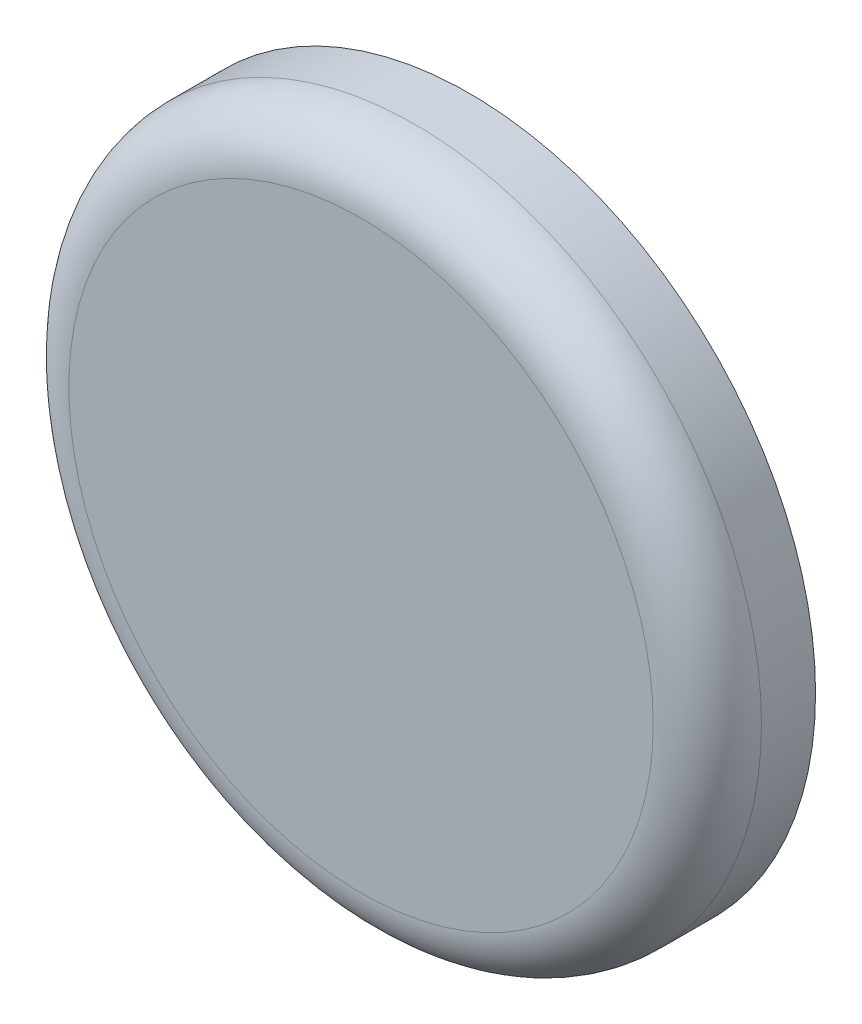
ISO-10303-21;
HEADER;
FILE_DESCRIPTION(('STEP AP214'),'2;1');
FILE_NAME('part.step','',(''),(''),'','','');
FILE_SCHEMA(('AUTOMOTIVE_DESIGN { 1 0 10303 214 1 1 1 1 }'));
ENDSEC;
DATA;
#1=APPLICATION_CONTEXT('core data for automotive mechanical design processes');
#2=APPLICATION_PROTOCOL_DEFINITION('international standard','automotive_design',2000,#1);
#3=PRODUCT_CONTEXT('',#1,'mechanical');
#4=PRODUCT('Part','Part','',(#3));
#5=PRODUCT_RELATED_PRODUCT_CATEGORY('part','',(#4));
#6=PRODUCT_DEFINITION_FORMATION('','',#4);
#7=PRODUCT_DEFINITION_CONTEXT('part definition',#1,'design');
#8=PRODUCT_DEFINITION('design','',#6,#7);
#9=PRODUCT_DEFINITION_SHAPE('','',#8);
#10=(LENGTH_UNIT() NAMED_UNIT(*) SI_UNIT(.MILLI.,.METRE.));
#11=(NAMED_UNIT(*) PLANE_ANGLE_UNIT() SI_UNIT($,.RADIAN.));
#12=(NAMED_UNIT(*) SI_UNIT($,.STERADIAN.) SOLID_ANGLE_UNIT());
#13=UNCERTAINTY_MEASURE_WITH_UNIT(LENGTH_MEASURE(1.E-05),#10,'distance_accuracy_value','');
#14=(GEOMETRIC_REPRESENTATION_CONTEXT(3) GLOBAL_UNCERTAINTY_ASSIGNED_CONTEXT((#13)) GLOBAL_UNIT_ASSIGNED_CONTEXT((#10,
#11,#12)) REPRESENTATION_CONTEXT('',''));
#15=CARTESIAN_POINT('',(0.,0.,0.));
#16=DIRECTION('',(0.,0.,1.));
#17=DIRECTION('',(1.,0.,0.));
#18=AXIS2_PLACEMENT_3D('',#15,#16,#17);
#19=CARTESIAN_POINT('',(0.,0.,10.));
#20=DIRECTION('',(0.,0.,-1.));
#21=DIRECTION('',(-1.,0.,0.));
#22=AXIS2_PLACEMENT_3D('',#19,#20,#21);
#23=CYLINDRICAL_SURFACE('',#22,32.);
#24=CARTESIAN_POINT('',(0.,0.,5.));
#25=DIRECTION('',(0.,0.,1.));
#26=DIRECTION('',(1.,0.,0.));
#27=AXIS2_PLACEMENT_3D('',#24,#25,#26);
#28=CIRCLE('',#27,32.);
#29=CARTESIAN_POINT('',(32.,0.,5.));
#30=VERTEX_POINT('',#29);
#31=EDGE_CURVE('E10',#30,#30,#28,.F.);
#32=ORIENTED_EDGE('',*,*,#31,.T.);
#33=EDGE_LOOP('',(#32));
#34=FACE_BOUND('',#33,.T.);
#35=CARTESIAN_POINT('',(0.,0.,0.));
#36=DIRECTION('',(0.,0.,1.));
#37=DIRECTION('',(1.,0.,0.));
#38=AXIS2_PLACEMENT_3D('',#35,#36,#37);
#39=CIRCLE('',#38,32.);
#40=CARTESIAN_POINT('',(32.,0.,0.));
#41=VERTEX_POINT('',#40);
#42=EDGE_CURVE('E48',#41,#41,#39,.T.);
#43=ORIENTED_EDGE('',*,*,#42,.T.);
#44=EDGE_LOOP('',(#43));
#45=FACE_BOUND('',#44,.T.);
#46=ADVANCED_FACE('F37',(#34,#45),#23,.T.);
#47=CARTESIAN_POINT('',(0.,0.,10.));
#48=DIRECTION('',(0.,0.,1.));
#49=DIRECTION('',(1.,0.,0.));
#50=AXIS2_PLACEMENT_3D('',#47,#48,#49);
#51=PLANE('',#50);
#52=CARTESIAN_POINT('',(0.,0.,10.));
#53=DIRECTION('',(0.,0.,1.));
#54=DIRECTION('',(1.,0.,0.));
#55=AXIS2_PLACEMENT_3D('',#52,#53,#54);
#56=CIRCLE('',#55,27.);
#57=CARTESIAN_POINT('',(27.,0.,10.));
#58=VERTEX_POINT('',#57);
#59=EDGE_CURVE('E44',#58,#58,#56,.T.);
#60=ORIENTED_EDGE('',*,*,#59,.T.);
#61=EDGE_LOOP('',(#60));
#62=FACE_BOUND('',#61,.T.);
#63=ADVANCED_FACE('F72',(#62),#51,.T.);
#64=CARTESIAN_POINT('',(0.,0.,0.));
#65=DIRECTION('',(0.,0.,1.));
#66=DIRECTION('',(1.,0.,0.));
#67=AXIS2_PLACEMENT_3D('',#64,#65,#66);
#68=PLANE('',#67);
#69=CARTESIAN_POINT('',(0.,0.,0.));
#70=DIRECTION('',(0.,0.,-1.));
#71=DIRECTION('',(-1.,0.,0.));
#72=AXIS2_PLACEMENT_3D('',#69,#70,#71);
#73=CIRCLE('',#72,27.);
#74=CARTESIAN_POINT('',(-27.,0.,0.));
#75=VERTEX_POINT('',#74);
#76=EDGE_CURVE('E55',#75,#75,#73,.T.);
#77=ORIENTED_EDGE('',*,*,#76,.F.);
#78=EDGE_LOOP('',(#77));
#79=FACE_BOUND('',#78,.T.);
#80=ORIENTED_EDGE('',*,*,#42,.F.);
#81=EDGE_LOOP('',(#80));
#82=FACE_BOUND('',#81,.T.);
#83=ADVANCED_FACE('F69',(#79,#82),#68,.F.);
#84=CARTESIAN_POINT('',(0.,0.,5.));
#85=DIRECTION('',(0.,0.,1.));
#86=DIRECTION('',(1.,0.,0.));
#87=AXIS2_PLACEMENT_3D('',#84,#85,#86);
#88=TOROIDAL_SURFACE('',#87,27.,5.);
#89=ORIENTED_EDGE('',*,*,#31,.F.);
#90=EDGE_LOOP('',(#89));
#91=FACE_BOUND('',#90,.T.);
#92=ORIENTED_EDGE('',*,*,#59,.F.);
#93=EDGE_LOOP('',(#92));
#94=FACE_BOUND('',#93,.T.);
#95=ADVANCED_FACE('F39',(#91,#94),#88,.T.);
#96=CARTESIAN_POINT('',(0.,0.,5.));
#97=DIRECTION('',(0.,0.,-1.));
#98=DIRECTION('',(-1.,0.,0.));
#99=AXIS2_PLACEMENT_3D('',#96,#97,#98);
#100=CYLINDRICAL_SURFACE('',#99,27.);
#101=CARTESIAN_POINT('',(0.,0.,5.));
#102=DIRECTION('',(0.,0.,-1.));
#103=DIRECTION('',(-1.,0.,0.));
#104=AXIS2_PLACEMENT_3D('',#101,#102,#103);
#105=CIRCLE('',#104,27.);
#106=CARTESIAN_POINT('',(-27.,0.,5.));
#107=VERTEX_POINT('',#106);
#108=EDGE_CURVE('E52',#107,#107,#105,.T.);
#109=ORIENTED_EDGE('',*,*,#108,.F.);
#110=EDGE_LOOP('',(#109));
#111=FACE_BOUND('',#110,.T.);
#112=ORIENTED_EDGE('',*,*,#76,.T.);
#113=EDGE_LOOP('',(#112));
#114=FACE_BOUND('',#113,.T.);
#115=ADVANCED_FACE('F63',(#111,#114),#100,.F.);
#116=CARTESIAN_POINT('',(0.,0.,5.));
#117=DIRECTION('',(0.,0.,-1.));
#118=DIRECTION('',(-1.,0.,0.));
#119=AXIS2_PLACEMENT_3D('',#116,#117,#118);
#120=PLANE('',#119);
#121=ORIENTED_EDGE('',*,*,#108,.T.);
#122=EDGE_LOOP('',(#121));
#123=FACE_BOUND('',#122,.T.);
#124=ADVANCED_FACE('F61',(#123),#120,.T.);
#125=CLOSED_SHELL('',(#46,#63,#83,#95,#115,#124));
#126=MANIFOLD_SOLID_BREP('B2',#125);
#127=ADVANCED_BREP_SHAPE_REPRESENTATION('',(#18,#126),#14);
#128=SHAPE_DEFINITION_REPRESENTATION(#9,#127);
ENDSEC;
END-ISO-10303-21;
